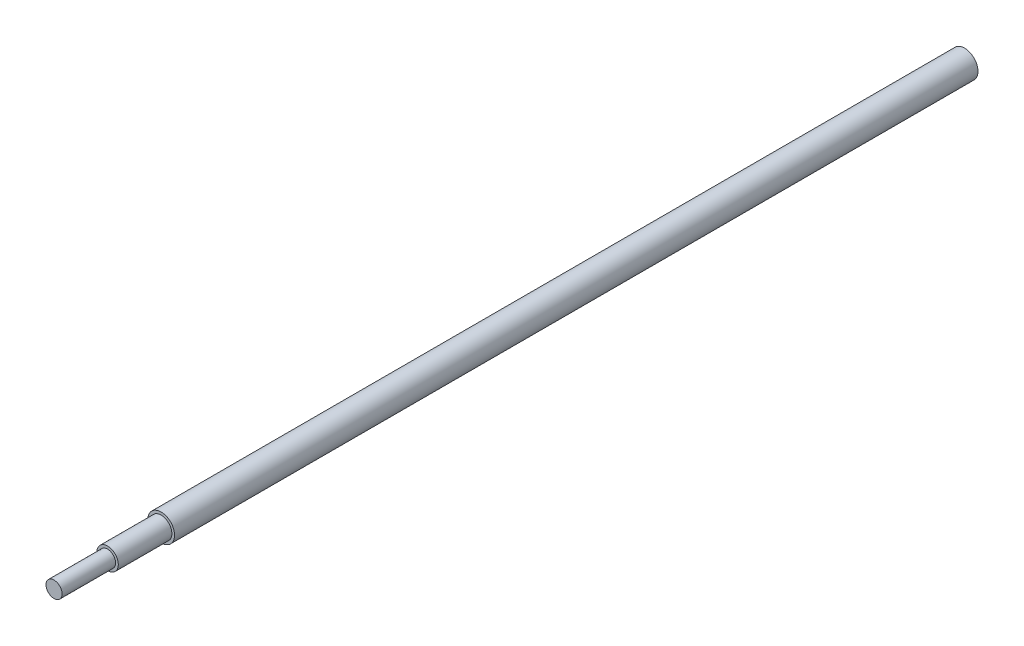
ISO-10303-21;
HEADER;
FILE_DESCRIPTION(('STEP AP214'),'2;1');
FILE_NAME('part.step','',(''),(''),'','','');
FILE_SCHEMA(('AUTOMOTIVE_DESIGN { 1 0 10303 214 1 1 1 1 }'));
ENDSEC;
DATA;
#1=APPLICATION_CONTEXT('core data for automotive mechanical design processes');
#2=APPLICATION_PROTOCOL_DEFINITION('international standard','automotive_design',2000,#1);
#3=PRODUCT_CONTEXT('',#1,'mechanical');
#4=PRODUCT('Part','Part','',(#3));
#5=PRODUCT_RELATED_PRODUCT_CATEGORY('part','',(#4));
#6=PRODUCT_DEFINITION_FORMATION('','',#4);
#7=PRODUCT_DEFINITION_CONTEXT('part definition',#1,'design');
#8=PRODUCT_DEFINITION('design','',#6,#7);
#9=PRODUCT_DEFINITION_SHAPE('','',#8);
#10=(LENGTH_UNIT() NAMED_UNIT(*) SI_UNIT(.MILLI.,.METRE.));
#11=(NAMED_UNIT(*) PLANE_ANGLE_UNIT() SI_UNIT($,.RADIAN.));
#12=(NAMED_UNIT(*) SI_UNIT($,.STERADIAN.) SOLID_ANGLE_UNIT());
#13=UNCERTAINTY_MEASURE_WITH_UNIT(LENGTH_MEASURE(1.E-05),#10,'distance_accuracy_value','');
#14=(GEOMETRIC_REPRESENTATION_CONTEXT(3) GLOBAL_UNCERTAINTY_ASSIGNED_CONTEXT((#13)) GLOBAL_UNIT_ASSIGNED_CONTEXT((#10,
#11,#12)) REPRESENTATION_CONTEXT('',''));
#15=CARTESIAN_POINT('',(0.,0.,0.));
#16=DIRECTION('',(0.,0.,1.));
#17=DIRECTION('',(1.,0.,0.));
#18=AXIS2_PLACEMENT_3D('',#15,#16,#17);
#19=CARTESIAN_POINT('',(0.,0.,170.));
#20=DIRECTION('',(0.,0.,1.));
#21=DIRECTION('',(1.,0.,0.));
#22=AXIS2_PLACEMENT_3D('',#19,#20,#21);
#23=PLANE('',#22);
#24=CARTESIAN_POINT('',(0.,0.,170.));
#25=DIRECTION('',(0.,0.,-1.));
#26=DIRECTION('',(-1.,0.,0.));
#27=AXIS2_PLACEMENT_3D('',#24,#25,#26);
#28=CIRCLE('',#27,1.5);
#29=CARTESIAN_POINT('',(-1.5,0.,170.));
#30=VERTEX_POINT('',#29);
#31=EDGE_CURVE('E18',#30,#30,#28,.T.);
#32=ORIENTED_EDGE('',*,*,#31,.F.);
#33=EDGE_LOOP('',(#32));
#34=FACE_BOUND('',#33,.T.);
#35=ADVANCED_FACE('F15',(#34),#23,.T.);
#36=CARTESIAN_POINT('',(0.,0.,170.));
#37=DIRECTION('',(0.,0.,-1.));
#38=DIRECTION('',(-1.,0.,0.));
#39=AXIS2_PLACEMENT_3D('',#36,#37,#38);
#40=CYLINDRICAL_SURFACE('',#39,1.5);
#41=ORIENTED_EDGE('',*,*,#31,.T.);
#42=EDGE_LOOP('',(#41));
#43=FACE_BOUND('',#42,.T.);
#44=CARTESIAN_POINT('',(0.,0.,160.));
#45=DIRECTION('',(0.,0.,-1.));
#46=DIRECTION('',(-1.,0.,0.));
#47=AXIS2_PLACEMENT_3D('',#44,#45,#46);
#48=CIRCLE('',#47,1.5);
#49=CARTESIAN_POINT('',(-1.5,0.,160.));
#50=VERTEX_POINT('',#49);
#51=EDGE_CURVE('E34',#50,#50,#48,.T.);
#52=ORIENTED_EDGE('',*,*,#51,.F.);
#53=EDGE_LOOP('',(#52));
#54=FACE_BOUND('',#53,.T.);
#55=ADVANCED_FACE('F41',(#43,#54),#40,.T.);
#56=CARTESIAN_POINT('',(0.,0.,160.));
#57=DIRECTION('',(0.,0.,1.));
#58=DIRECTION('',(1.,0.,0.));
#59=AXIS2_PLACEMENT_3D('',#56,#57,#58);
#60=PLANE('',#59);
#61=ORIENTED_EDGE('',*,*,#51,.T.);
#62=EDGE_LOOP('',(#61));
#63=FACE_BOUND('',#62,.T.);
#64=CARTESIAN_POINT('',(0.,0.,160.));
#65=DIRECTION('',(0.,0.,-1.));
#66=DIRECTION('',(-1.,0.,0.));
#67=AXIS2_PLACEMENT_3D('',#64,#65,#66);
#68=CIRCLE('',#67,2.);
#69=CARTESIAN_POINT('',(-2.,0.,160.));
#70=VERTEX_POINT('',#69);
#71=EDGE_CURVE('E32',#70,#70,#68,.T.);
#72=ORIENTED_EDGE('',*,*,#71,.F.);
#73=EDGE_LOOP('',(#72));
#74=FACE_BOUND('',#73,.T.);
#75=ADVANCED_FACE('F49',(#63,#74),#60,.T.);
#76=CARTESIAN_POINT('',(0.,0.,170.));
#77=DIRECTION('',(0.,0.,-1.));
#78=DIRECTION('',(-1.,0.,0.));
#79=AXIS2_PLACEMENT_3D('',#76,#77,#78);
#80=CYLINDRICAL_SURFACE('',#79,2.);
#81=CARTESIAN_POINT('',(0.,0.,150.));
#82=DIRECTION('',(0.,0.,-1.));
#83=DIRECTION('',(-1.,0.,0.));
#84=AXIS2_PLACEMENT_3D('',#81,#82,#83);
#85=CIRCLE('',#84,2.);
#86=CARTESIAN_POINT('',(-2.,0.,150.));
#87=VERTEX_POINT('',#86);
#88=EDGE_CURVE('E27',#87,#87,#85,.T.);
#89=ORIENTED_EDGE('',*,*,#88,.F.);
#90=EDGE_LOOP('',(#89));
#91=FACE_BOUND('',#90,.T.);
#92=ORIENTED_EDGE('',*,*,#71,.T.);
#93=EDGE_LOOP('',(#92));
#94=FACE_BOUND('',#93,.T.);
#95=ADVANCED_FACE('F64',(#91,#94),#80,.T.);
#96=CARTESIAN_POINT('',(0.,0.,150.));
#97=DIRECTION('',(0.,0.,1.));
#98=DIRECTION('',(1.,0.,0.));
#99=AXIS2_PLACEMENT_3D('',#96,#97,#98);
#100=PLANE('',#99);
#101=ORIENTED_EDGE('',*,*,#88,.T.);
#102=EDGE_LOOP('',(#101));
#103=FACE_BOUND('',#102,.T.);
#104=CARTESIAN_POINT('',(0.,0.,150.));
#105=DIRECTION('',(0.,0.,1.));
#106=DIRECTION('',(1.,0.,0.));
#107=AXIS2_PLACEMENT_3D('',#104,#105,#106);
#108=CIRCLE('',#107,2.5);
#109=CARTESIAN_POINT('',(2.5,0.,150.));
#110=VERTEX_POINT('',#109);
#111=EDGE_CURVE('E22',#110,#110,#108,.F.);
#112=ORIENTED_EDGE('',*,*,#111,.F.);
#113=EDGE_LOOP('',(#112));
#114=FACE_BOUND('',#113,.T.);
#115=ADVANCED_FACE('F57',(#103,#114),#100,.T.);
#116=CARTESIAN_POINT('',(0.,0.,0.));
#117=DIRECTION('',(0.,0.,1.));
#118=DIRECTION('',(1.,0.,0.));
#119=AXIS2_PLACEMENT_3D('',#116,#117,#118);
#120=PLANE('',#119);
#121=CARTESIAN_POINT('',(0.,0.,0.));
#122=DIRECTION('',(0.,0.,1.));
#123=DIRECTION('',(1.,0.,0.));
#124=AXIS2_PLACEMENT_3D('',#121,#122,#123);
#125=CIRCLE('',#124,2.5);
#126=CARTESIAN_POINT('',(2.5,0.,0.));
#127=VERTEX_POINT('',#126);
#128=EDGE_CURVE('E10',#127,#127,#125,.T.);
#129=ORIENTED_EDGE('',*,*,#128,.F.);
#130=EDGE_LOOP('',(#129));
#131=FACE_BOUND('',#130,.T.);
#132=ADVANCED_FACE('F52',(#131),#120,.F.);
#133=CARTESIAN_POINT('',(0.,0.,0.));
#134=DIRECTION('',(0.,0.,1.));
#135=DIRECTION('',(1.,0.,0.));
#136=AXIS2_PLACEMENT_3D('',#133,#134,#135);
#137=CYLINDRICAL_SURFACE('',#136,2.5);
#138=ORIENTED_EDGE('',*,*,#128,.T.);
#139=EDGE_LOOP('',(#138));
#140=FACE_BOUND('',#139,.T.);
#141=ORIENTED_EDGE('',*,*,#111,.T.);
#142=EDGE_LOOP('',(#141));
#143=FACE_BOUND('',#142,.T.);
#144=ADVANCED_FACE('F50',(#140,#143),#137,.T.);
#145=CLOSED_SHELL('',(#35,#55,#75,#95,#115,#132,#144));
#146=MANIFOLD_SOLID_BREP('B1',#145);
#147=ADVANCED_BREP_SHAPE_REPRESENTATION('',(#18,#146),#14);
#148=SHAPE_DEFINITION_REPRESENTATION(#9,#147);
ENDSEC;
END-ISO-10303-21;
